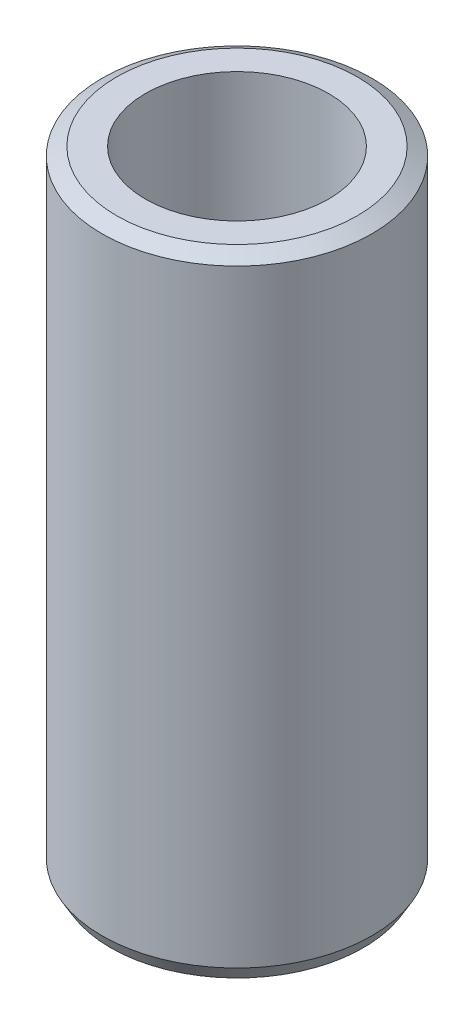
ISO-10303-21;
HEADER;
FILE_DESCRIPTION(('STEP AP214'),'2;1');
FILE_NAME('part.step','',(''),(''),'','','');
FILE_SCHEMA(('AUTOMOTIVE_DESIGN { 1 0 10303 214 1 1 1 1 }'));
ENDSEC;
DATA;
#1=APPLICATION_CONTEXT('core data for automotive mechanical design processes');
#2=APPLICATION_PROTOCOL_DEFINITION('international standard','automotive_design',2000,#1);
#3=PRODUCT_CONTEXT('',#1,'mechanical');
#4=PRODUCT('Part','Part','',(#3));
#5=PRODUCT_RELATED_PRODUCT_CATEGORY('part','',(#4));
#6=PRODUCT_DEFINITION_FORMATION('','',#4);
#7=PRODUCT_DEFINITION_CONTEXT('part definition',#1,'design');
#8=PRODUCT_DEFINITION('design','',#6,#7);
#9=PRODUCT_DEFINITION_SHAPE('','',#8);
#10=(LENGTH_UNIT() NAMED_UNIT(*) SI_UNIT(.MILLI.,.METRE.));
#11=(NAMED_UNIT(*) PLANE_ANGLE_UNIT() SI_UNIT($,.RADIAN.));
#12=(NAMED_UNIT(*) SI_UNIT($,.STERADIAN.) SOLID_ANGLE_UNIT());
#13=UNCERTAINTY_MEASURE_WITH_UNIT(LENGTH_MEASURE(1.E-05),#10,'distance_accuracy_value','');
#14=(GEOMETRIC_REPRESENTATION_CONTEXT(3) GLOBAL_UNCERTAINTY_ASSIGNED_CONTEXT((#13)) GLOBAL_UNIT_ASSIGNED_CONTEXT((#10,
#11,#12)) REPRESENTATION_CONTEXT('',''));
#15=CARTESIAN_POINT('',(0.,0.,0.));
#16=DIRECTION('',(0.,0.,1.));
#17=DIRECTION('',(1.,0.,0.));
#18=AXIS2_PLACEMENT_3D('',#15,#16,#17);
#19=CARTESIAN_POINT('',(0.,210.496306697346,0.));
#20=DIRECTION('',(0.,-1.,0.));
#21=DIRECTION('',(0.,0.,-1.));
#22=AXIS2_PLACEMENT_3D('',#19,#20,#21);
#23=CYLINDRICAL_SURFACE('',#22,45.);
#24=CARTESIAN_POINT('',(0.,207.694124844029,0.));
#25=DIRECTION('',(0.,1.,0.));
#26=DIRECTION('',(0.,0.,1.));
#27=AXIS2_PLACEMENT_3D('',#24,#25,#26);
#28=CIRCLE('',#27,45.);
#29=CARTESIAN_POINT('',(0.,207.694124844029,-45.));
#30=VERTEX_POINT('',#29);
#31=EDGE_CURVE('E50',#30,#30,#28,.F.);
#32=ORIENTED_EDGE('',*,*,#31,.T.);
#33=EDGE_LOOP('',(#32));
#34=FACE_BOUND('',#33,.T.);
#35=CARTESIAN_POINT('',(0.,4.85352134199143,0.));
#36=DIRECTION('',(0.,1.,0.));
#37=DIRECTION('',(0.,0.,1.));
#38=AXIS2_PLACEMENT_3D('',#35,#36,#37);
#39=CIRCLE('',#38,45.);
#40=CARTESIAN_POINT('',(0.,4.85352134199143,45.));
#41=VERTEX_POINT('',#40);
#42=EDGE_CURVE('E51',#41,#41,#39,.T.);
#43=ORIENTED_EDGE('',*,*,#42,.T.);
#44=EDGE_LOOP('',(#43));
#45=FACE_BOUND('',#44,.T.);
#46=ADVANCED_FACE('F39',(#34,#45),#23,.T.);
#47=CARTESIAN_POINT('',(0.,210.496306697346,0.));
#48=DIRECTION('',(0.,1.,0.));
#49=DIRECTION('',(0.,0.,1.));
#50=AXIS2_PLACEMENT_3D('',#47,#48,#49);
#51=PLANE('',#50);
#52=CARTESIAN_POINT('',(0.,210.496306697346,0.));
#53=DIRECTION('',(0.,1.,0.));
#54=DIRECTION('',(0.,0.,1.));
#55=AXIS2_PLACEMENT_3D('',#52,#53,#54);
#56=CIRCLE('',#55,40.1464786580085);
#57=CARTESIAN_POINT('',(0.,210.496306697346,-40.1464786580085));
#58=VERTEX_POINT('',#57);
#59=EDGE_CURVE('E54',#58,#58,#56,.T.);
#60=ORIENTED_EDGE('',*,*,#59,.T.);
#61=EDGE_LOOP('',(#60));
#62=FACE_BOUND('',#61,.T.);
#63=CARTESIAN_POINT('',(0.,210.496306697346,0.));
#64=DIRECTION('',(0.,1.,0.));
#65=DIRECTION('',(0.,0.,1.));
#66=AXIS2_PLACEMENT_3D('',#63,#64,#65);
#67=CIRCLE('',#66,30.5492150285631);
#68=CARTESIAN_POINT('',(0.,210.496306697346,30.5492150285631));
#69=VERTEX_POINT('',#68);
#70=EDGE_CURVE('E58',#69,#69,#67,.T.);
#71=ORIENTED_EDGE('',*,*,#70,.F.);
#72=EDGE_LOOP('',(#71));
#73=FACE_BOUND('',#72,.T.);
#74=ADVANCED_FACE('F69',(#62,#73),#51,.T.);
#75=CARTESIAN_POINT('',(0.,0.,0.));
#76=DIRECTION('',(0.,1.,0.));
#77=DIRECTION('',(0.,0.,1.));
#78=AXIS2_PLACEMENT_3D('',#75,#76,#77);
#79=PLANE('',#78);
#80=CARTESIAN_POINT('',(0.,0.,0.));
#81=DIRECTION('',(0.,1.,0.));
#82=DIRECTION('',(0.,0.,1.));
#83=AXIS2_PLACEMENT_3D('',#80,#81,#82);
#84=CIRCLE('',#83,42.1978181466836);
#85=CARTESIAN_POINT('',(0.,0.,42.1978181466836));
#86=VERTEX_POINT('',#85);
#87=EDGE_CURVE('E10',#86,#86,#84,.F.);
#88=ORIENTED_EDGE('',*,*,#87,.T.);
#89=EDGE_LOOP('',(#88));
#90=FACE_BOUND('',#89,.T.);
#91=CARTESIAN_POINT('',(0.,0.,0.));
#92=DIRECTION('',(0.,1.,0.));
#93=DIRECTION('',(0.,0.,1.));
#94=AXIS2_PLACEMENT_3D('',#91,#92,#93);
#95=CIRCLE('',#94,30.5492150285631);
#96=CARTESIAN_POINT('',(0.,0.,30.5492150285631));
#97=VERTEX_POINT('',#96);
#98=EDGE_CURVE('E63',#97,#97,#95,.T.);
#99=ORIENTED_EDGE('',*,*,#98,.T.);
#100=EDGE_LOOP('',(#99));
#101=FACE_BOUND('',#100,.T.);
#102=ADVANCED_FACE('F75',(#90,#101),#79,.F.);
#103=CARTESIAN_POINT('',(0.,210.496306697346,0.));
#104=DIRECTION('',(0.,-1.,0.));
#105=DIRECTION('',(0.,0.,-1.));
#106=AXIS2_PLACEMENT_3D('',#103,#104,#105);
#107=CYLINDRICAL_SURFACE('',#106,30.5492150285631);
#108=ORIENTED_EDGE('',*,*,#70,.T.);
#109=EDGE_LOOP('',(#108));
#110=FACE_BOUND('',#109,.T.);
#111=ORIENTED_EDGE('',*,*,#98,.F.);
#112=EDGE_LOOP('',(#111));
#113=FACE_BOUND('',#112,.T.);
#114=ADVANCED_FACE('F70',(#110,#113),#107,.F.);
#115=CARTESIAN_POINT('',(0.,210.496306697346,0.));
#116=DIRECTION('',(0.,-1.,0.));
#117=DIRECTION('',(0.,0.,-1.));
#118=AXIS2_PLACEMENT_3D('',#115,#116,#117);
#119=CONICAL_SURFACE('',#118,40.1464786580085,1.0471975511966);
#120=CARTESIAN_POINT('',(0.,207.694124844029,-45.));
#121=CARTESIAN_POINT('',(0.,207.723314238335,-44.9494424860209));
#122=CARTESIAN_POINT('',(0.,207.75250363264,-44.8988849720419));
#123=CARTESIAN_POINT('',(0.,207.810882421251,-44.7977699440837));
#124=CARTESIAN_POINT('',(0.,207.840071815556,-44.7472124301046));
#125=CARTESIAN_POINT('',(0.,207.898450604167,-44.6460974021465));
#126=CARTESIAN_POINT('',(0.,207.927639998473,-44.5955398881674));
#127=CARTESIAN_POINT('',(0.,207.986018787083,-44.4944248602093));
#128=CARTESIAN_POINT('',(0.,208.015208181389,-44.4438673462302));
#129=CARTESIAN_POINT('',(0.,208.073586969999,-44.342752318272));
#130=CARTESIAN_POINT('',(0.,208.102776364305,-44.2921948042929));
#131=CARTESIAN_POINT('',(0.,208.161155152916,-44.1910797763348));
#132=CARTESIAN_POINT('',(0.,208.190344547221,-44.1405222623557));
#133=CARTESIAN_POINT('',(0.,208.248723335832,-44.0394072343976));
#134=CARTESIAN_POINT('',(0.,208.277912730137,-43.9888497204185));
#135=CARTESIAN_POINT('',(0.,208.336291518748,-43.8877346924603));
#136=CARTESIAN_POINT('',(0.,208.365480913053,-43.8371771784812));
#137=CARTESIAN_POINT('',(0.,208.423859701664,-43.7360621505231));
#138=CARTESIAN_POINT('',(0.,208.453049095969,-43.685504636544));
#139=CARTESIAN_POINT('',(0.,208.51142788458,-43.5843896085859));
#140=CARTESIAN_POINT('',(0.,208.540617278885,-43.5338320946068));
#141=CARTESIAN_POINT('',(0.,208.598996067496,-43.4327170666486));
#142=CARTESIAN_POINT('',(0.,208.628185461802,-43.3821595526695));
#143=CARTESIAN_POINT('',(0.,208.686564250412,-43.2810445247114));
#144=CARTESIAN_POINT('',(0.,208.715753644718,-43.2304870107323));
#145=CARTESIAN_POINT('',(0.,208.774132433328,-43.1293719827741));
#146=CARTESIAN_POINT('',(0.,208.803321827634,-43.0788144687951));
#147=CARTESIAN_POINT('',(0.,208.861700616245,-42.9776994408369));
#148=CARTESIAN_POINT('',(0.,208.89089001055,-42.9271419268578));
#149=CARTESIAN_POINT('',(0.,208.949268799161,-42.8260268988997));
#150=CARTESIAN_POINT('',(0.,208.978458193466,-42.7754693849206));
#151=CARTESIAN_POINT('',(0.,209.036836982077,-42.6743543569624));
#152=CARTESIAN_POINT('',(0.,209.066026376382,-42.6237968429834));
#153=CARTESIAN_POINT('',(0.,209.124405164993,-42.5226818150252));
#154=CARTESIAN_POINT('',(0.,209.153594559298,-42.4721243010461));
#155=CARTESIAN_POINT('',(0.,209.211973347909,-42.371009273088));
#156=CARTESIAN_POINT('',(0.,209.241162742215,-42.3204517591089));
#157=CARTESIAN_POINT('',(0.,209.299541530825,-42.2193367311507));
#158=CARTESIAN_POINT('',(0.,209.328730925131,-42.1687792171717));
#159=CARTESIAN_POINT('',(0.,209.387109713741,-42.0676641892135));
#160=CARTESIAN_POINT('',(0.,209.416299108047,-42.0171066752344));
#161=CARTESIAN_POINT('',(0.,209.474677896658,-41.9159916472763));
#162=CARTESIAN_POINT('',(0.,209.503867290963,-41.8654341332972));
#163=CARTESIAN_POINT('',(0.,209.562246079574,-41.764319105339));
#164=CARTESIAN_POINT('',(0.,209.591435473879,-41.71376159136));
#165=CARTESIAN_POINT('',(0.,209.64981426249,-41.6126465634018));
#166=CARTESIAN_POINT('',(0.,209.679003656795,-41.5620890494227));
#167=CARTESIAN_POINT('',(0.,209.737382445406,-41.4609740214646));
#168=CARTESIAN_POINT('',(0.,209.766571839711,-41.4104165074855));
#169=CARTESIAN_POINT('',(0.,209.824950628322,-41.3093014795273));
#170=CARTESIAN_POINT('',(0.,209.854140022628,-41.2587439655483));
#171=CARTESIAN_POINT('',(0.,209.912518811238,-41.1576289375901));
#172=CARTESIAN_POINT('',(0.,209.941708205544,-41.107071423611));
#173=CARTESIAN_POINT('',(0.,210.000086994154,-41.0059563956529));
#174=CARTESIAN_POINT('',(0.,210.02927638846,-40.9553988816738));
#175=CARTESIAN_POINT('',(0.,210.087655177071,-40.8542838537156));
#176=CARTESIAN_POINT('',(0.,210.116844571376,-40.8037263397366));
#177=CARTESIAN_POINT('',(0.,210.175223359987,-40.7026113117784));
#178=CARTESIAN_POINT('',(0.,210.204412754292,-40.6520537977993));
#179=CARTESIAN_POINT('',(0.,210.262791542903,-40.5509387698412));
#180=CARTESIAN_POINT('',(0.,210.291980937208,-40.5003812558621));
#181=CARTESIAN_POINT('',(0.,210.350359725819,-40.3992662279039));
#182=CARTESIAN_POINT('',(0.,210.379549120124,-40.3487087139249));
#183=CARTESIAN_POINT('',(0.,210.437927908735,-40.2475936859667));
#184=CARTESIAN_POINT('',(0.,210.46711730304,-40.1970361719876));
#185=CARTESIAN_POINT('',(0.,210.496306697346,-40.1464786580085));
#186=B_SPLINE_CURVE_WITH_KNOTS('',3,(#120,#121,#122,#123,#124,#125,#126,#127,#128,#129,#130,
#131,#132,#133,#134,#135,#136,#137,#138,#139,#140,#141,#142,#143,#144,#145,#146,#147,#148,#149,
#150,#151,#152,#153,#154,#155,#156,#157,#158,#159,#160,#161,#162,#163,#164,#165,#166,#167,#168,
#169,#170,#171,#172,#173,#174,#175,#176,#177,#178,#179,#180,#181,#182,#183,#184,#185),
.UNSPECIFIED.,.F.,.F.,(4,2,2,2,2,2,2,2,2,2,2,2,2,2,2,2,2,2,2,2,2,2,2,2,2,2,2,2,2,2,2,2,4),(0.,
0.175136365832276,0.350272731664546,0.525409097496822,0.700545463329098,0.875681829161368,
1.05081819499364,1.22595456082591,1.40109092665819,1.57622729249047,1.75136365832274,
1.92650002415501,2.10163638998729,2.27677275581956,2.45190912165183,2.6270454874841,
2.80218185331638,2.97731821914865,3.15245458498093,3.3275909508132,3.50272731664547,
3.67786368247775,3.85300004831003,4.02813641414229,4.20327277997458,4.37840914580686,
4.55354551163913,4.72868187747141,4.90381824330368,5.07895460913595,5.25409097496822,
5.4292273408005,5.60436370663278),.UNSPECIFIED.);
#187=EDGE_CURVE('BSEAM81',#30,#58,#186,.T.);
#188=ORIENTED_EDGE('',*,*,#31,.F.);
#189=ORIENTED_EDGE('',*,*,#59,.F.);
#190=ORIENTED_EDGE('',*,*,#187,.T.);
#191=ORIENTED_EDGE('',*,*,#187,.F.);
#192=EDGE_LOOP('',(#188,#190,#189,#191));
#193=FACE_BOUND('',#192,.T.);
#194=ADVANCED_FACE('F81',(#193),#119,.T.);
#195=CARTESIAN_POINT('',(0.,4.85352134199143,0.));
#196=DIRECTION('',(0.,1.,0.));
#197=DIRECTION('',(0.,0.,1.));
#198=AXIS2_PLACEMENT_3D('',#195,#196,#197);
#199=CONICAL_SURFACE('',#198,45.,0.523598775598302);
#200=ORIENTED_EDGE('',*,*,#87,.F.);
#201=EDGE_LOOP('',(#200));
#202=FACE_BOUND('',#201,.T.);
#203=ORIENTED_EDGE('',*,*,#42,.F.);
#204=EDGE_LOOP('',(#203));
#205=FACE_BOUND('',#204,.T.);
#206=ADVANCED_FACE('F45',(#202,#205),#199,.T.);
#207=CLOSED_SHELL('',(#46,#74,#102,#114,#194,#206));
#208=MANIFOLD_SOLID_BREP('B2',#207);
#209=ADVANCED_BREP_SHAPE_REPRESENTATION('',(#18,#208),#14);
#210=SHAPE_DEFINITION_REPRESENTATION(#9,#209);
ENDSEC;
END-ISO-10303-21;
